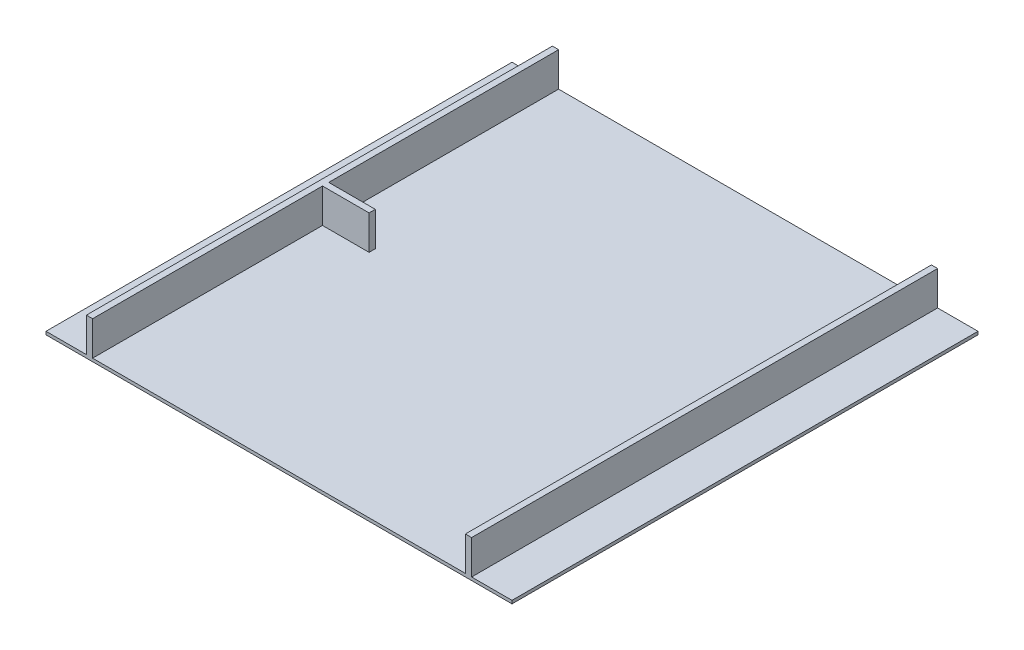
ISO-10303-21;
HEADER;
FILE_DESCRIPTION(('STEP AP214'),'2;1');
FILE_NAME('part.step','',(''),(''),'','','');
FILE_SCHEMA(('AUTOMOTIVE_DESIGN { 1 0 10303 214 1 1 1 1 }'));
ENDSEC;
DATA;
#1=APPLICATION_CONTEXT('core data for automotive mechanical design processes');
#2=APPLICATION_PROTOCOL_DEFINITION('international standard','automotive_design',2000,#1);
#3=PRODUCT_CONTEXT('',#1,'mechanical');
#4=PRODUCT('Part','Part','',(#3));
#5=PRODUCT_RELATED_PRODUCT_CATEGORY('part','',(#4));
#6=PRODUCT_DEFINITION_FORMATION('','',#4);
#7=PRODUCT_DEFINITION_CONTEXT('part definition',#1,'design');
#8=PRODUCT_DEFINITION('design','',#6,#7);
#9=PRODUCT_DEFINITION_SHAPE('','',#8);
#10=(LENGTH_UNIT() NAMED_UNIT(*) SI_UNIT(.MILLI.,.METRE.));
#11=(NAMED_UNIT(*) PLANE_ANGLE_UNIT() SI_UNIT($,.RADIAN.));
#12=(NAMED_UNIT(*) SI_UNIT($,.STERADIAN.) SOLID_ANGLE_UNIT());
#13=UNCERTAINTY_MEASURE_WITH_UNIT(LENGTH_MEASURE(1.E-05),#10,'distance_accuracy_value','');
#14=(GEOMETRIC_REPRESENTATION_CONTEXT(3) GLOBAL_UNCERTAINTY_ASSIGNED_CONTEXT((#13)) GLOBAL_UNIT_ASSIGNED_CONTEXT((#10,
#11,#12)) REPRESENTATION_CONTEXT('',''));
#15=CARTESIAN_POINT('',(0.,0.,0.));
#16=DIRECTION('',(0.,0.,1.));
#17=DIRECTION('',(1.,0.,0.));
#18=AXIS2_PLACEMENT_3D('',#15,#16,#17);
#19=CARTESIAN_POINT('',(0.,10.,0.));
#20=DIRECTION('',(0.,1.,0.));
#21=DIRECTION('',(0.,0.,1.));
#22=AXIS2_PLACEMENT_3D('',#19,#20,#21);
#23=PLANE('',#22);
#24=DIRECTION('',(1.,0.,0.));
#25=VECTOR('',#24,1.);
#26=CARTESIAN_POINT('',(-750.,10.,750.));
#27=LINE('',#26,#25);
#28=CARTESIAN_POINT('',(-600.,10.,750.));
#29=VERTEX_POINT('',#28);
#30=CARTESIAN_POINT('',(600.,10.,750.));
#31=VERTEX_POINT('',#30);
#32=EDGE_CURVE('E228',#29,#31,#27,.T.);
#33=ORIENTED_EDGE('',*,*,#32,.T.);
#34=DIRECTION('',(0.,0.,1.));
#35=VECTOR('',#34,1.);
#36=CARTESIAN_POINT('',(600.,10.,-1.33226762955019E-13));
#37=LINE('',#36,#35);
#38=CARTESIAN_POINT('',(600.,10.,-750.));
#39=VERTEX_POINT('',#38);
#40=EDGE_CURVE('E54',#39,#31,#37,.T.);
#41=ORIENTED_EDGE('',*,*,#40,.F.);
#42=DIRECTION('',(-1.,0.,0.));
#43=VECTOR('',#42,1.);
#44=CARTESIAN_POINT('',(-750.,10.,-750.));
#45=LINE('',#44,#43);
#46=CARTESIAN_POINT('',(-600.,10.,-750.));
#47=VERTEX_POINT('',#46);
#48=EDGE_CURVE('E40',#39,#47,#45,.T.);
#49=ORIENTED_EDGE('',*,*,#48,.T.);
#50=DIRECTION('',(0.,0.,1.));
#51=VECTOR('',#50,1.);
#52=CARTESIAN_POINT('',(-600.,10.,0.));
#53=LINE('',#52,#51);
#54=CARTESIAN_POINT('',(-600.,10.,-10.0000000000001));
#55=VERTEX_POINT('',#54);
#56=EDGE_CURVE('E161',#47,#55,#53,.T.);
#57=ORIENTED_EDGE('',*,*,#56,.T.);
#58=DIRECTION('',(1.,0.,0.));
#59=VECTOR('',#58,1.);
#60=CARTESIAN_POINT('',(0.,10.,-10.0000000000001));
#61=LINE('',#60,#59);
#62=CARTESIAN_POINT('',(-450.,10.,-10.0000000000001));
#63=VERTEX_POINT('',#62);
#64=EDGE_CURVE('E192',#55,#63,#61,.T.);
#65=ORIENTED_EDGE('',*,*,#64,.T.);
#66=DIRECTION('',(0.,0.,1.));
#67=VECTOR('',#66,1.);
#68=CARTESIAN_POINT('',(-450.,10.,0.));
#69=LINE('',#68,#67);
#70=CARTESIAN_POINT('',(-450.,10.,9.9999999999999));
#71=VERTEX_POINT('',#70);
#72=EDGE_CURVE('E263',#63,#71,#69,.T.);
#73=ORIENTED_EDGE('',*,*,#72,.T.);
#74=DIRECTION('',(1.,0.,0.));
#75=VECTOR('',#74,1.);
#76=CARTESIAN_POINT('',(0.,10.,9.9999999999999));
#77=LINE('',#76,#75);
#78=CARTESIAN_POINT('',(-600.,10.,9.9999999999999));
#79=VERTEX_POINT('',#78);
#80=EDGE_CURVE('E218',#79,#71,#77,.T.);
#81=ORIENTED_EDGE('',*,*,#80,.F.);
#82=EDGE_CURVE('E216',#79,#29,#53,.T.);
#83=ORIENTED_EDGE('',*,*,#82,.T.);
#84=EDGE_LOOP('',(#33,#41,#49,#57,#65,#73,#81,#83));
#85=FACE_BOUND('',#84,.T.);
#86=ADVANCED_FACE('F36',(#85),#23,.T.);
#87=DIRECTION('',(0.,0.,1.));
#88=VECTOR('',#87,1.);
#89=CARTESIAN_POINT('',(620.,10.,-1.37667655053519E-13));
#90=LINE('',#89,#88);
#91=CARTESIAN_POINT('',(620.000000000001,10.,-750.));
#92=VERTEX_POINT('',#91);
#93=CARTESIAN_POINT('',(620.,10.,750.));
#94=VERTEX_POINT('',#93);
#95=EDGE_CURVE('E159',#92,#94,#90,.T.);
#96=ORIENTED_EDGE('',*,*,#95,.T.);
#97=CARTESIAN_POINT('',(750.,10.,750.));
#98=VERTEX_POINT('',#97);
#99=EDGE_CURVE('E226',#94,#98,#27,.T.);
#100=ORIENTED_EDGE('',*,*,#99,.T.);
#101=DIRECTION('',(0.,0.,-1.));
#102=VECTOR('',#101,1.);
#103=CARTESIAN_POINT('',(750.,10.,-750.));
#104=LINE('',#103,#102);
#105=CARTESIAN_POINT('',(750.,10.,-750.));
#106=VERTEX_POINT('',#105);
#107=EDGE_CURVE('E245',#98,#106,#104,.T.);
#108=ORIENTED_EDGE('',*,*,#107,.T.);
#109=EDGE_CURVE('E62',#106,#92,#45,.T.);
#110=ORIENTED_EDGE('',*,*,#109,.T.);
#111=EDGE_LOOP('',(#96,#100,#108,#110));
#112=FACE_BOUND('',#111,.T.);
#113=ADVANCED_FACE('F321',(#112),#23,.T.);
#114=CARTESIAN_POINT('',(750.,10.,-750.));
#115=DIRECTION('',(-1.,0.,0.));
#116=DIRECTION('',(0.,0.,1.));
#117=AXIS2_PLACEMENT_3D('',#114,#115,#116);
#118=PLANE('',#117);
#119=DIRECTION('',(0.,0.,-1.));
#120=VECTOR('',#119,1.);
#121=CARTESIAN_POINT('',(750.,0.,-750.));
#122=LINE('',#121,#120);
#123=CARTESIAN_POINT('',(750.,0.,750.));
#124=VERTEX_POINT('',#123);
#125=CARTESIAN_POINT('',(750.,0.,-750.));
#126=VERTEX_POINT('',#125);
#127=EDGE_CURVE('E233',#124,#126,#122,.T.);
#128=ORIENTED_EDGE('',*,*,#127,.T.);
#129=DIRECTION('',(0.,-1.,0.));
#130=VECTOR('',#129,1.);
#131=CARTESIAN_POINT('',(750.,10.,-750.));
#132=LINE('',#131,#130);
#133=EDGE_CURVE('E11',#106,#126,#132,.T.);
#134=ORIENTED_EDGE('',*,*,#133,.F.);
#135=ORIENTED_EDGE('',*,*,#107,.F.);
#136=DIRECTION('',(0.,-1.,0.));
#137=VECTOR('',#136,1.);
#138=CARTESIAN_POINT('',(750.,10.,750.));
#139=LINE('',#138,#137);
#140=EDGE_CURVE('E242',#98,#124,#139,.T.);
#141=ORIENTED_EDGE('',*,*,#140,.T.);
#142=EDGE_LOOP('',(#128,#134,#135,#141));
#143=FACE_BOUND('',#142,.T.);
#144=ADVANCED_FACE('F38',(#143),#118,.F.);
#145=CARTESIAN_POINT('',(-750.,10.,-750.));
#146=DIRECTION('',(0.,0.,1.));
#147=DIRECTION('',(1.,0.,0.));
#148=AXIS2_PLACEMENT_3D('',#145,#146,#147);
#149=PLANE('',#148);
#150=DIRECTION('',(-1.,0.,0.));
#151=VECTOR('',#150,1.);
#152=CARTESIAN_POINT('',(-750.,0.,-750.));
#153=LINE('',#152,#151);
#154=CARTESIAN_POINT('',(-750.,0.,-750.));
#155=VERTEX_POINT('',#154);
#156=EDGE_CURVE('E344',#126,#155,#153,.T.);
#157=ORIENTED_EDGE('',*,*,#156,.T.);
#158=DIRECTION('',(0.,-1.,0.));
#159=VECTOR('',#158,1.);
#160=CARTESIAN_POINT('',(-750.,10.,-750.));
#161=LINE('',#160,#159);
#162=CARTESIAN_POINT('',(-750.,10.,-750.));
#163=VERTEX_POINT('',#162);
#164=EDGE_CURVE('E46',#163,#155,#161,.T.);
#165=ORIENTED_EDGE('',*,*,#164,.F.);
#166=CARTESIAN_POINT('',(-620.,10.,-750.));
#167=VERTEX_POINT('',#166);
#168=EDGE_CURVE('E243',#167,#163,#45,.T.);
#169=ORIENTED_EDGE('',*,*,#168,.F.);
#170=DIRECTION('',(0.,-1.,0.));
#171=VECTOR('',#170,1.);
#172=CARTESIAN_POINT('',(-620.,120.,-750.));
#173=LINE('',#172,#171);
#174=CARTESIAN_POINT('',(-620.,120.,-750.));
#175=VERTEX_POINT('',#174);
#176=EDGE_CURVE('E294',#175,#167,#173,.T.);
#177=ORIENTED_EDGE('',*,*,#176,.F.);
#178=DIRECTION('',(-1.,0.,0.));
#179=VECTOR('',#178,1.);
#180=CARTESIAN_POINT('',(0.,120.,-750.));
#181=LINE('',#180,#179);
#182=CARTESIAN_POINT('',(-600.,120.,-750.));
#183=VERTEX_POINT('',#182);
#184=EDGE_CURVE('E191',#183,#175,#181,.T.);
#185=ORIENTED_EDGE('',*,*,#184,.F.);
#186=DIRECTION('',(0.,-1.,0.));
#187=VECTOR('',#186,1.);
#188=CARTESIAN_POINT('',(-600.,120.,-750.));
#189=LINE('',#188,#187);
#190=EDGE_CURVE('E287',#183,#47,#189,.T.);
#191=ORIENTED_EDGE('',*,*,#190,.T.);
#192=ORIENTED_EDGE('',*,*,#48,.F.);
#193=DIRECTION('',(0.,-1.,0.));
#194=VECTOR('',#193,1.);
#195=CARTESIAN_POINT('',(600.,120.,-750.));
#196=LINE('',#195,#194);
#197=CARTESIAN_POINT('',(600.,120.,-750.));
#198=VERTEX_POINT('',#197);
#199=EDGE_CURVE('E162',#198,#39,#196,.T.);
#200=ORIENTED_EDGE('',*,*,#199,.F.);
#201=DIRECTION('',(-1.,0.,0.));
#202=VECTOR('',#201,1.);
#203=CARTESIAN_POINT('',(0.,120.,-750.));
#204=LINE('',#203,#202);
#205=CARTESIAN_POINT('',(620.,120.,-750.));
#206=VERTEX_POINT('',#205);
#207=EDGE_CURVE('E165',#206,#198,#204,.T.);
#208=ORIENTED_EDGE('',*,*,#207,.F.);
#209=DIRECTION('',(0.,-1.,0.));
#210=VECTOR('',#209,1.);
#211=CARTESIAN_POINT('',(620.,120.,-750.));
#212=LINE('',#211,#210);
#213=EDGE_CURVE('E153',#206,#92,#212,.T.);
#214=ORIENTED_EDGE('',*,*,#213,.T.);
#215=ORIENTED_EDGE('',*,*,#109,.F.);
#216=ORIENTED_EDGE('',*,*,#133,.T.);
#217=EDGE_LOOP('',(#157,#165,#169,#177,#185,#191,#192,#200,#208,#214,#215,#216));
#218=FACE_BOUND('',#217,.T.);
#219=ADVANCED_FACE('F166',(#218),#149,.F.);
#220=CARTESIAN_POINT('',(-750.,10.,-750.));
#221=DIRECTION('',(1.,0.,0.));
#222=DIRECTION('',(0.,0.,-1.));
#223=AXIS2_PLACEMENT_3D('',#220,#221,#222);
#224=PLANE('',#223);
#225=DIRECTION('',(0.,0.,1.));
#226=VECTOR('',#225,1.);
#227=CARTESIAN_POINT('',(-750.,0.,-750.));
#228=LINE('',#227,#226);
#229=CARTESIAN_POINT('',(-750.,0.,750.));
#230=VERTEX_POINT('',#229);
#231=EDGE_CURVE('E349',#155,#230,#228,.T.);
#232=ORIENTED_EDGE('',*,*,#231,.T.);
#233=DIRECTION('',(0.,-1.,0.));
#234=VECTOR('',#233,1.);
#235=CARTESIAN_POINT('',(-750.,10.,750.));
#236=LINE('',#235,#234);
#237=CARTESIAN_POINT('',(-750.,10.,750.));
#238=VERTEX_POINT('',#237);
#239=EDGE_CURVE('E355',#238,#230,#236,.T.);
#240=ORIENTED_EDGE('',*,*,#239,.F.);
#241=DIRECTION('',(0.,0.,1.));
#242=VECTOR('',#241,1.);
#243=CARTESIAN_POINT('',(-750.,10.,-750.));
#244=LINE('',#243,#242);
#245=EDGE_CURVE('E229',#163,#238,#244,.T.);
#246=ORIENTED_EDGE('',*,*,#245,.F.);
#247=ORIENTED_EDGE('',*,*,#164,.T.);
#248=EDGE_LOOP('',(#232,#240,#246,#247));
#249=FACE_BOUND('',#248,.T.);
#250=ADVANCED_FACE('F335',(#249),#224,.F.);
#251=CARTESIAN_POINT('',(-750.,10.,750.));
#252=DIRECTION('',(0.,0.,-1.));
#253=DIRECTION('',(-1.,0.,0.));
#254=AXIS2_PLACEMENT_3D('',#251,#252,#253);
#255=PLANE('',#254);
#256=DIRECTION('',(1.,0.,0.));
#257=VECTOR('',#256,1.);
#258=CARTESIAN_POINT('',(-750.,0.,750.));
#259=LINE('',#258,#257);
#260=EDGE_CURVE('E251',#230,#124,#259,.T.);
#261=ORIENTED_EDGE('',*,*,#260,.T.);
#262=ORIENTED_EDGE('',*,*,#140,.F.);
#263=ORIENTED_EDGE('',*,*,#99,.F.);
#264=DIRECTION('',(0.,-1.,0.));
#265=VECTOR('',#264,1.);
#266=CARTESIAN_POINT('',(620.,120.,750.));
#267=LINE('',#266,#265);
#268=CARTESIAN_POINT('',(620.,120.,750.));
#269=VERTEX_POINT('',#268);
#270=EDGE_CURVE('E181',#269,#94,#267,.T.);
#271=ORIENTED_EDGE('',*,*,#270,.F.);
#272=DIRECTION('',(1.,0.,0.));
#273=VECTOR('',#272,1.);
#274=CARTESIAN_POINT('',(0.,120.,750.));
#275=LINE('',#274,#273);
#276=CARTESIAN_POINT('',(600.,120.,750.));
#277=VERTEX_POINT('',#276);
#278=EDGE_CURVE('E174',#277,#269,#275,.T.);
#279=ORIENTED_EDGE('',*,*,#278,.F.);
#280=DIRECTION('',(0.,-1.,0.));
#281=VECTOR('',#280,1.);
#282=CARTESIAN_POINT('',(600.,120.,750.));
#283=LINE('',#282,#281);
#284=EDGE_CURVE('E184',#277,#31,#283,.T.);
#285=ORIENTED_EDGE('',*,*,#284,.T.);
#286=ORIENTED_EDGE('',*,*,#32,.F.);
#287=DIRECTION('',(0.,-1.,0.));
#288=VECTOR('',#287,1.);
#289=CARTESIAN_POINT('',(-600.,120.,750.));
#290=LINE('',#289,#288);
#291=CARTESIAN_POINT('',(-600.,120.,750.));
#292=VERTEX_POINT('',#291);
#293=EDGE_CURVE('E220',#292,#29,#290,.T.);
#294=ORIENTED_EDGE('',*,*,#293,.F.);
#295=DIRECTION('',(1.,0.,0.));
#296=VECTOR('',#295,1.);
#297=CARTESIAN_POINT('',(0.,120.,750.));
#298=LINE('',#297,#296);
#299=CARTESIAN_POINT('',(-620.,120.,750.));
#300=VERTEX_POINT('',#299);
#301=EDGE_CURVE('E197',#300,#292,#298,.T.);
#302=ORIENTED_EDGE('',*,*,#301,.F.);
#303=DIRECTION('',(0.,-1.,0.));
#304=VECTOR('',#303,1.);
#305=CARTESIAN_POINT('',(-620.,120.,750.));
#306=LINE('',#305,#304);
#307=CARTESIAN_POINT('',(-620.,10.,750.));
#308=VERTEX_POINT('',#307);
#309=EDGE_CURVE('E223',#300,#308,#306,.T.);
#310=ORIENTED_EDGE('',*,*,#309,.T.);
#311=EDGE_CURVE('E240',#238,#308,#27,.T.);
#312=ORIENTED_EDGE('',*,*,#311,.F.);
#313=ORIENTED_EDGE('',*,*,#239,.T.);
#314=EDGE_LOOP('',(#261,#262,#263,#271,#279,#285,#286,#294,#302,#310,#312,#313));
#315=FACE_BOUND('',#314,.T.);
#316=ADVANCED_FACE('F306',(#315),#255,.F.);
#317=DIRECTION('',(0.,0.,1.));
#318=VECTOR('',#317,1.);
#319=CARTESIAN_POINT('',(-620.,10.,0.));
#320=LINE('',#319,#318);
#321=EDGE_CURVE('E219',#167,#308,#320,.T.);
#322=ORIENTED_EDGE('',*,*,#321,.F.);
#323=ORIENTED_EDGE('',*,*,#168,.T.);
#324=ORIENTED_EDGE('',*,*,#245,.T.);
#325=ORIENTED_EDGE('',*,*,#311,.T.);
#326=EDGE_LOOP('',(#322,#323,#324,#325));
#327=FACE_BOUND('',#326,.T.);
#328=ADVANCED_FACE('F323',(#327),#23,.T.);
#329=CARTESIAN_POINT('',(0.,0.,0.));
#330=DIRECTION('',(0.,1.,0.));
#331=DIRECTION('',(0.,0.,1.));
#332=AXIS2_PLACEMENT_3D('',#329,#330,#331);
#333=PLANE('',#332);
#334=ORIENTED_EDGE('',*,*,#127,.F.);
#335=ORIENTED_EDGE('',*,*,#260,.F.);
#336=ORIENTED_EDGE('',*,*,#231,.F.);
#337=ORIENTED_EDGE('',*,*,#156,.F.);
#338=EDGE_LOOP('',(#334,#335,#336,#337));
#339=FACE_BOUND('',#338,.T.);
#340=ADVANCED_FACE('F319',(#339),#333,.F.);
#341=CARTESIAN_POINT('',(-600.,120.,0.));
#342=DIRECTION('',(1.,0.,0.));
#343=DIRECTION('',(0.,0.,-1.));
#344=AXIS2_PLACEMENT_3D('',#341,#342,#343);
#345=PLANE('',#344);
#346=ORIENTED_EDGE('',*,*,#56,.F.);
#347=ORIENTED_EDGE('',*,*,#190,.F.);
#348=DIRECTION('',(0.,0.,1.));
#349=VECTOR('',#348,1.);
#350=CARTESIAN_POINT('',(-600.,120.,0.));
#351=LINE('',#350,#349);
#352=CARTESIAN_POINT('',(-600.,120.,-10.0000000000001));
#353=VERTEX_POINT('',#352);
#354=EDGE_CURVE('E188',#183,#353,#351,.T.);
#355=ORIENTED_EDGE('',*,*,#354,.T.);
#356=DIRECTION('',(0.,-1.,0.));
#357=VECTOR('',#356,1.);
#358=CARTESIAN_POINT('',(-600.,120.,-10.0000000000001));
#359=LINE('',#358,#357);
#360=EDGE_CURVE('E207',#353,#55,#359,.T.);
#361=ORIENTED_EDGE('',*,*,#360,.T.);
#362=EDGE_LOOP('',(#346,#347,#355,#361));
#363=FACE_BOUND('',#362,.T.);
#364=ADVANCED_FACE('F285',(#363),#345,.T.);
#365=CARTESIAN_POINT('',(-620.,120.,0.));
#366=DIRECTION('',(1.,0.,0.));
#367=DIRECTION('',(0.,0.,-1.));
#368=AXIS2_PLACEMENT_3D('',#365,#366,#367);
#369=PLANE('',#368);
#370=ORIENTED_EDGE('',*,*,#321,.T.);
#371=ORIENTED_EDGE('',*,*,#309,.F.);
#372=DIRECTION('',(0.,0.,1.));
#373=VECTOR('',#372,1.);
#374=CARTESIAN_POINT('',(-620.,120.,0.));
#375=LINE('',#374,#373);
#376=EDGE_CURVE('E195',#175,#300,#375,.T.);
#377=ORIENTED_EDGE('',*,*,#376,.F.);
#378=ORIENTED_EDGE('',*,*,#176,.T.);
#379=EDGE_LOOP('',(#370,#371,#377,#378));
#380=FACE_BOUND('',#379,.T.);
#381=ADVANCED_FACE('F299',(#380),#369,.F.);
#382=ORIENTED_EDGE('',*,*,#82,.F.);
#383=DIRECTION('',(0.,-1.,0.));
#384=VECTOR('',#383,1.);
#385=CARTESIAN_POINT('',(-600.,120.,9.9999999999999));
#386=LINE('',#385,#384);
#387=CARTESIAN_POINT('',(-600.,120.,9.9999999999999));
#388=VERTEX_POINT('',#387);
#389=EDGE_CURVE('E224',#388,#79,#386,.T.);
#390=ORIENTED_EDGE('',*,*,#389,.F.);
#391=EDGE_CURVE('E193',#388,#292,#351,.T.);
#392=ORIENTED_EDGE('',*,*,#391,.T.);
#393=ORIENTED_EDGE('',*,*,#293,.T.);
#394=EDGE_LOOP('',(#382,#390,#392,#393));
#395=FACE_BOUND('',#394,.T.);
#396=ADVANCED_FACE('F309',(#395),#345,.T.);
#397=CARTESIAN_POINT('',(0.,120.,9.9999999999999));
#398=DIRECTION('',(0.,0.,-1.));
#399=DIRECTION('',(-1.,0.,0.));
#400=AXIS2_PLACEMENT_3D('',#397,#398,#399);
#401=PLANE('',#400);
#402=ORIENTED_EDGE('',*,*,#80,.T.);
#403=DIRECTION('',(0.,-1.,0.));
#404=VECTOR('',#403,1.);
#405=CARTESIAN_POINT('',(-450.,120.,9.9999999999999));
#406=LINE('',#405,#404);
#407=CARTESIAN_POINT('',(-450.,120.,9.9999999999999));
#408=VERTEX_POINT('',#407);
#409=EDGE_CURVE('E254',#408,#71,#406,.T.);
#410=ORIENTED_EDGE('',*,*,#409,.F.);
#411=DIRECTION('',(1.,0.,0.));
#412=VECTOR('',#411,1.);
#413=CARTESIAN_POINT('',(0.,120.,9.9999999999999));
#414=LINE('',#413,#412);
#415=EDGE_CURVE('E199',#388,#408,#414,.T.);
#416=ORIENTED_EDGE('',*,*,#415,.F.);
#417=ORIENTED_EDGE('',*,*,#389,.T.);
#418=EDGE_LOOP('',(#402,#410,#416,#417));
#419=FACE_BOUND('',#418,.T.);
#420=ADVANCED_FACE('F267',(#419),#401,.F.);
#421=CARTESIAN_POINT('',(-450.,120.,0.));
#422=DIRECTION('',(1.,0.,0.));
#423=DIRECTION('',(0.,0.,-1.));
#424=AXIS2_PLACEMENT_3D('',#421,#422,#423);
#425=PLANE('',#424);
#426=ORIENTED_EDGE('',*,*,#72,.F.);
#427=DIRECTION('',(0.,-1.,0.));
#428=VECTOR('',#427,1.);
#429=CARTESIAN_POINT('',(-450.,120.,-10.0000000000001));
#430=LINE('',#429,#428);
#431=CARTESIAN_POINT('',(-450.,120.,-10.0000000000001));
#432=VERTEX_POINT('',#431);
#433=EDGE_CURVE('E257',#432,#63,#430,.T.);
#434=ORIENTED_EDGE('',*,*,#433,.F.);
#435=DIRECTION('',(0.,0.,1.));
#436=VECTOR('',#435,1.);
#437=CARTESIAN_POINT('',(-450.,120.,0.));
#438=LINE('',#437,#436);
#439=EDGE_CURVE('E201',#432,#408,#438,.T.);
#440=ORIENTED_EDGE('',*,*,#439,.T.);
#441=ORIENTED_EDGE('',*,*,#409,.T.);
#442=EDGE_LOOP('',(#426,#434,#440,#441));
#443=FACE_BOUND('',#442,.T.);
#444=ADVANCED_FACE('F274',(#443),#425,.T.);
#445=CARTESIAN_POINT('',(0.,120.,-10.0000000000001));
#446=DIRECTION('',(0.,0.,-1.));
#447=DIRECTION('',(-1.,0.,0.));
#448=AXIS2_PLACEMENT_3D('',#445,#446,#447);
#449=PLANE('',#448);
#450=ORIENTED_EDGE('',*,*,#64,.F.);
#451=ORIENTED_EDGE('',*,*,#360,.F.);
#452=DIRECTION('',(1.,0.,0.));
#453=VECTOR('',#452,1.);
#454=CARTESIAN_POINT('',(0.,120.,-10.0000000000001));
#455=LINE('',#454,#453);
#456=EDGE_CURVE('E204',#353,#432,#455,.T.);
#457=ORIENTED_EDGE('',*,*,#456,.T.);
#458=ORIENTED_EDGE('',*,*,#433,.T.);
#459=EDGE_LOOP('',(#450,#451,#457,#458));
#460=FACE_BOUND('',#459,.T.);
#461=ADVANCED_FACE('F282',(#460),#449,.T.);
#462=CARTESIAN_POINT('',(0.,120.,0.));
#463=DIRECTION('',(0.,1.,0.));
#464=DIRECTION('',(0.,0.,1.));
#465=AXIS2_PLACEMENT_3D('',#462,#463,#464);
#466=PLANE('',#465);
#467=ORIENTED_EDGE('',*,*,#354,.F.);
#468=ORIENTED_EDGE('',*,*,#184,.T.);
#469=ORIENTED_EDGE('',*,*,#376,.T.);
#470=ORIENTED_EDGE('',*,*,#301,.T.);
#471=ORIENTED_EDGE('',*,*,#391,.F.);
#472=ORIENTED_EDGE('',*,*,#415,.T.);
#473=ORIENTED_EDGE('',*,*,#439,.F.);
#474=ORIENTED_EDGE('',*,*,#456,.F.);
#475=EDGE_LOOP('',(#467,#468,#469,#470,#471,#472,#473,#474));
#476=FACE_BOUND('',#475,.T.);
#477=ADVANCED_FACE('F279',(#476),#466,.T.);
#478=CARTESIAN_POINT('',(620.,120.,-1.37667655053519E-13));
#479=DIRECTION('',(1.,0.,0.));
#480=DIRECTION('',(0.,0.,-1.));
#481=AXIS2_PLACEMENT_3D('',#478,#479,#480);
#482=PLANE('',#481);
#483=ORIENTED_EDGE('',*,*,#95,.F.);
#484=ORIENTED_EDGE('',*,*,#213,.F.);
#485=DIRECTION('',(0.,0.,1.));
#486=VECTOR('',#485,1.);
#487=CARTESIAN_POINT('',(620.,120.,-1.37667655053519E-13));
#488=LINE('',#487,#486);
#489=EDGE_CURVE('E158',#206,#269,#488,.T.);
#490=ORIENTED_EDGE('',*,*,#489,.T.);
#491=ORIENTED_EDGE('',*,*,#270,.T.);
#492=EDGE_LOOP('',(#483,#484,#490,#491));
#493=FACE_BOUND('',#492,.T.);
#494=ADVANCED_FACE('F155',(#493),#482,.T.);
#495=CARTESIAN_POINT('',(600.,120.,-1.33226762955019E-13));
#496=DIRECTION('',(1.,0.,0.));
#497=DIRECTION('',(0.,0.,-1.));
#498=AXIS2_PLACEMENT_3D('',#495,#496,#497);
#499=PLANE('',#498);
#500=ORIENTED_EDGE('',*,*,#40,.T.);
#501=ORIENTED_EDGE('',*,*,#284,.F.);
#502=DIRECTION('',(0.,0.,1.));
#503=VECTOR('',#502,1.);
#504=CARTESIAN_POINT('',(600.,120.,-1.33226762955019E-13));
#505=LINE('',#504,#503);
#506=EDGE_CURVE('E170',#198,#277,#505,.T.);
#507=ORIENTED_EDGE('',*,*,#506,.F.);
#508=ORIENTED_EDGE('',*,*,#199,.T.);
#509=EDGE_LOOP('',(#500,#501,#507,#508));
#510=FACE_BOUND('',#509,.T.);
#511=ADVANCED_FACE('F367',(#510),#499,.F.);
#512=CARTESIAN_POINT('',(0.,120.,0.));
#513=DIRECTION('',(0.,1.,0.));
#514=DIRECTION('',(0.,0.,1.));
#515=AXIS2_PLACEMENT_3D('',#512,#513,#514);
#516=PLANE('',#515);
#517=ORIENTED_EDGE('',*,*,#489,.F.);
#518=ORIENTED_EDGE('',*,*,#207,.T.);
#519=ORIENTED_EDGE('',*,*,#506,.T.);
#520=ORIENTED_EDGE('',*,*,#278,.T.);
#521=EDGE_LOOP('',(#517,#518,#519,#520));
#522=FACE_BOUND('',#521,.T.);
#523=ADVANCED_FACE('F172',(#522),#516,.T.);
#524=CLOSED_SHELL('',(#86,#113,#144,#219,#250,#316,#328,#340,#364,#381,#396,#420,#444,#461,#477,
#494,#511,#523));
#525=MANIFOLD_SOLID_BREP('B2',#524);
#526=ADVANCED_BREP_SHAPE_REPRESENTATION('',(#18,#525),#14);
#527=SHAPE_DEFINITION_REPRESENTATION(#9,#526);
ENDSEC;
END-ISO-10303-21;
